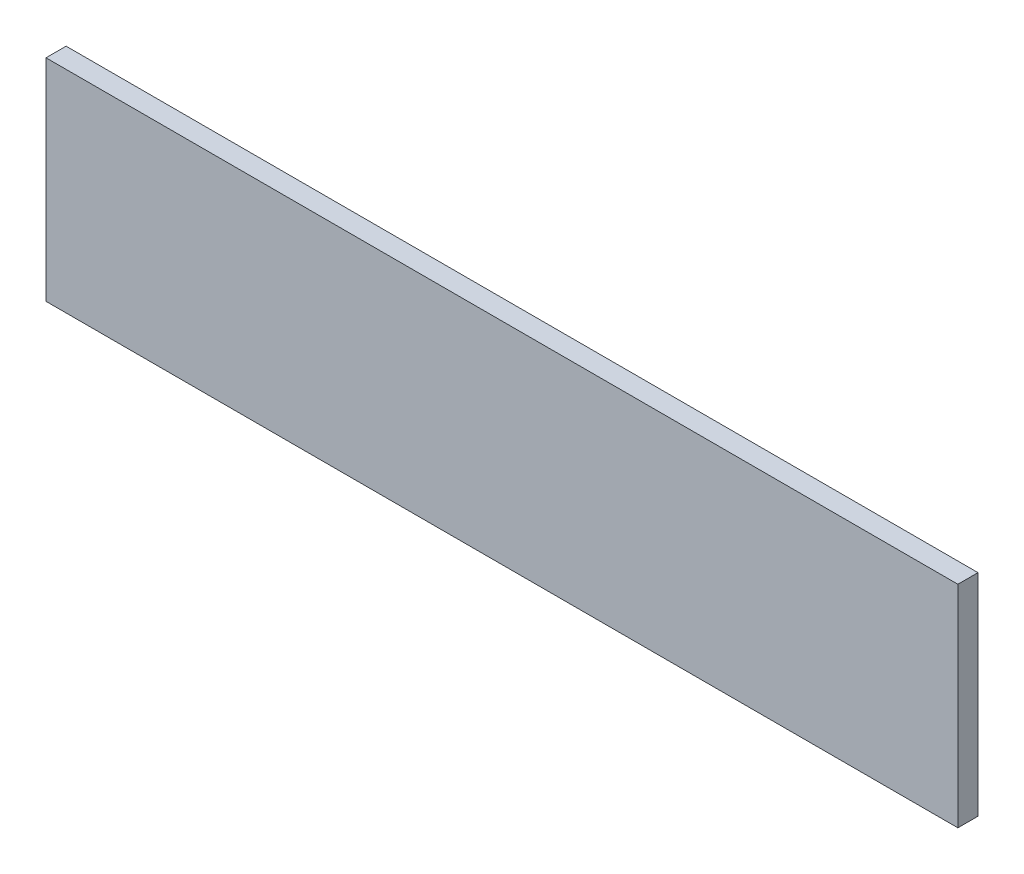
ISO-10303-21;
HEADER;
FILE_DESCRIPTION(('STEP AP214'),'2;1');
FILE_NAME('part.step','',(''),(''),'','','');
FILE_SCHEMA(('AUTOMOTIVE_DESIGN { 1 0 10303 214 1 1 1 1 }'));
ENDSEC;
DATA;
#1=APPLICATION_CONTEXT('core data for automotive mechanical design processes');
#2=APPLICATION_PROTOCOL_DEFINITION('international standard','automotive_design',2000,#1);
#3=PRODUCT_CONTEXT('',#1,'mechanical');
#4=PRODUCT('Part','Part','',(#3));
#5=PRODUCT_RELATED_PRODUCT_CATEGORY('part','',(#4));
#6=PRODUCT_DEFINITION_FORMATION('','',#4);
#7=PRODUCT_DEFINITION_CONTEXT('part definition',#1,'design');
#8=PRODUCT_DEFINITION('design','',#6,#7);
#9=PRODUCT_DEFINITION_SHAPE('','',#8);
#10=(LENGTH_UNIT() NAMED_UNIT(*) SI_UNIT(.MILLI.,.METRE.));
#11=(NAMED_UNIT(*) PLANE_ANGLE_UNIT() SI_UNIT($,.RADIAN.));
#12=(NAMED_UNIT(*) SI_UNIT($,.STERADIAN.) SOLID_ANGLE_UNIT());
#13=UNCERTAINTY_MEASURE_WITH_UNIT(LENGTH_MEASURE(1.E-05),#10,'distance_accuracy_value','');
#14=(GEOMETRIC_REPRESENTATION_CONTEXT(3) GLOBAL_UNCERTAINTY_ASSIGNED_CONTEXT((#13)) GLOBAL_UNIT_ASSIGNED_CONTEXT((#10,
#11,#12)) REPRESENTATION_CONTEXT('',''));
#15=CARTESIAN_POINT('',(0.,0.,0.));
#16=DIRECTION('',(0.,0.,1.));
#17=DIRECTION('',(1.,0.,0.));
#18=AXIS2_PLACEMENT_3D('',#15,#16,#17);
#19=CARTESIAN_POINT('',(138.67,32.08,-3.06));
#20=DIRECTION('',(0.,-1.,0.));
#21=DIRECTION('',(0.,0.,-1.));
#22=AXIS2_PLACEMENT_3D('',#19,#20,#21);
#23=PLANE('',#22);
#24=DIRECTION('',(0.,0.,1.));
#25=VECTOR('',#24,1.);
#26=CARTESIAN_POINT('',(0.,32.08,-3.06));
#27=LINE('',#26,#25);
#28=CARTESIAN_POINT('',(0.,32.08,-3.06));
#29=VERTEX_POINT('',#28);
#30=CARTESIAN_POINT('',(0.,32.08,0.));
#31=VERTEX_POINT('',#30);
#32=EDGE_CURVE('E102',#29,#31,#27,.T.);
#33=ORIENTED_EDGE('',*,*,#32,.T.);
#34=DIRECTION('',(-1.,0.,0.));
#35=VECTOR('',#34,1.);
#36=CARTESIAN_POINT('',(138.67,32.08,0.));
#37=LINE('',#36,#35);
#38=CARTESIAN_POINT('',(138.67,32.08,0.));
#39=VERTEX_POINT('',#38);
#40=EDGE_CURVE('E11',#39,#31,#37,.T.);
#41=ORIENTED_EDGE('',*,*,#40,.F.);
#42=DIRECTION('',(0.,0.,1.));
#43=VECTOR('',#42,1.);
#44=CARTESIAN_POINT('',(138.67,32.08,-3.06));
#45=LINE('',#44,#43);
#46=CARTESIAN_POINT('',(138.67,32.08,-3.06));
#47=VERTEX_POINT('',#46);
#48=EDGE_CURVE('E90',#47,#39,#45,.T.);
#49=ORIENTED_EDGE('',*,*,#48,.F.);
#50=DIRECTION('',(-1.,0.,0.));
#51=VECTOR('',#50,1.);
#52=CARTESIAN_POINT('',(138.67,32.08,-3.06));
#53=LINE('',#52,#51);
#54=EDGE_CURVE('E98',#47,#29,#53,.T.);
#55=ORIENTED_EDGE('',*,*,#54,.T.);
#56=EDGE_LOOP('',(#33,#41,#49,#55));
#57=FACE_BOUND('',#56,.T.);
#58=ADVANCED_FACE('F39',(#57),#23,.F.);
#59=CARTESIAN_POINT('',(138.67,32.08,0.));
#60=DIRECTION('',(0.,0.,-1.));
#61=DIRECTION('',(-1.,0.,0.));
#62=AXIS2_PLACEMENT_3D('',#59,#60,#61);
#63=PLANE('',#62);
#64=DIRECTION('',(0.,-1.,0.));
#65=VECTOR('',#64,1.);
#66=CARTESIAN_POINT('',(0.,32.08,0.));
#67=LINE('',#66,#65);
#68=CARTESIAN_POINT('',(0.,0.,0.));
#69=VERTEX_POINT('',#68);
#70=EDGE_CURVE('E94',#31,#69,#67,.T.);
#71=ORIENTED_EDGE('',*,*,#70,.T.);
#72=DIRECTION('',(-1.,0.,0.));
#73=VECTOR('',#72,1.);
#74=CARTESIAN_POINT('',(138.67,0.,0.));
#75=LINE('',#74,#73);
#76=CARTESIAN_POINT('',(138.67,0.,0.));
#77=VERTEX_POINT('',#76);
#78=EDGE_CURVE('E47',#77,#69,#75,.T.);
#79=ORIENTED_EDGE('',*,*,#78,.F.);
#80=DIRECTION('',(0.,-1.,0.));
#81=VECTOR('',#80,1.);
#82=CARTESIAN_POINT('',(138.67,32.08,0.));
#83=LINE('',#82,#81);
#84=EDGE_CURVE('E85',#39,#77,#83,.T.);
#85=ORIENTED_EDGE('',*,*,#84,.F.);
#86=ORIENTED_EDGE('',*,*,#40,.T.);
#87=EDGE_LOOP('',(#71,#79,#85,#86));
#88=FACE_BOUND('',#87,.T.);
#89=ADVANCED_FACE('F93',(#88),#63,.F.);
#90=CARTESIAN_POINT('',(138.67,0.,-3.06));
#91=DIRECTION('',(0.,1.,0.));
#92=DIRECTION('',(0.,0.,1.));
#93=AXIS2_PLACEMENT_3D('',#90,#91,#92);
#94=PLANE('',#93);
#95=DIRECTION('',(0.,0.,-1.));
#96=VECTOR('',#95,1.);
#97=CARTESIAN_POINT('',(0.,0.,-3.06));
#98=LINE('',#97,#96);
#99=CARTESIAN_POINT('',(0.,0.,-3.06));
#100=VERTEX_POINT('',#99);
#101=EDGE_CURVE('E72',#69,#100,#98,.T.);
#102=ORIENTED_EDGE('',*,*,#101,.T.);
#103=DIRECTION('',(-1.,0.,0.));
#104=VECTOR('',#103,1.);
#105=CARTESIAN_POINT('',(138.67,0.,-3.06));
#106=LINE('',#105,#104);
#107=CARTESIAN_POINT('',(138.67,0.,-3.06));
#108=VERTEX_POINT('',#107);
#109=EDGE_CURVE('E95',#108,#100,#106,.T.);
#110=ORIENTED_EDGE('',*,*,#109,.F.);
#111=DIRECTION('',(0.,0.,-1.));
#112=VECTOR('',#111,1.);
#113=CARTESIAN_POINT('',(138.67,0.,-3.06));
#114=LINE('',#113,#112);
#115=EDGE_CURVE('E88',#77,#108,#114,.T.);
#116=ORIENTED_EDGE('',*,*,#115,.F.);
#117=ORIENTED_EDGE('',*,*,#78,.T.);
#118=EDGE_LOOP('',(#102,#110,#116,#117));
#119=FACE_BOUND('',#118,.T.);
#120=ADVANCED_FACE('F96',(#119),#94,.F.);
#121=CARTESIAN_POINT('',(138.67,32.08,-3.06));
#122=DIRECTION('',(0.,0.,1.));
#123=DIRECTION('',(1.,0.,0.));
#124=AXIS2_PLACEMENT_3D('',#121,#122,#123);
#125=PLANE('',#124);
#126=DIRECTION('',(0.,1.,0.));
#127=VECTOR('',#126,1.);
#128=CARTESIAN_POINT('',(0.,32.08,-3.06));
#129=LINE('',#128,#127);
#130=EDGE_CURVE('E78',#100,#29,#129,.T.);
#131=ORIENTED_EDGE('',*,*,#130,.T.);
#132=ORIENTED_EDGE('',*,*,#54,.F.);
#133=DIRECTION('',(0.,1.,0.));
#134=VECTOR('',#133,1.);
#135=CARTESIAN_POINT('',(138.67,32.08,-3.06));
#136=LINE('',#135,#134);
#137=EDGE_CURVE('E55',#108,#47,#136,.T.);
#138=ORIENTED_EDGE('',*,*,#137,.F.);
#139=ORIENTED_EDGE('',*,*,#109,.T.);
#140=EDGE_LOOP('',(#131,#132,#138,#139));
#141=FACE_BOUND('',#140,.T.);
#142=ADVANCED_FACE('F109',(#141),#125,.F.);
#143=CARTESIAN_POINT('',(138.67,0.,0.));
#144=DIRECTION('',(1.,0.,0.));
#145=DIRECTION('',(0.,0.,-1.));
#146=AXIS2_PLACEMENT_3D('',#143,#144,#145);
#147=PLANE('',#146);
#148=ORIENTED_EDGE('',*,*,#48,.T.);
#149=ORIENTED_EDGE('',*,*,#84,.T.);
#150=ORIENTED_EDGE('',*,*,#115,.T.);
#151=ORIENTED_EDGE('',*,*,#137,.T.);
#152=EDGE_LOOP('',(#148,#149,#150,#151));
#153=FACE_BOUND('',#152,.T.);
#154=ADVANCED_FACE('F86',(#153),#147,.T.);
#155=CARTESIAN_POINT('',(0.,0.,0.));
#156=DIRECTION('',(1.,0.,0.));
#157=DIRECTION('',(0.,0.,-1.));
#158=AXIS2_PLACEMENT_3D('',#155,#156,#157);
#159=PLANE('',#158);
#160=ORIENTED_EDGE('',*,*,#32,.F.);
#161=ORIENTED_EDGE('',*,*,#130,.F.);
#162=ORIENTED_EDGE('',*,*,#101,.F.);
#163=ORIENTED_EDGE('',*,*,#70,.F.);
#164=EDGE_LOOP('',(#160,#161,#162,#163));
#165=FACE_BOUND('',#164,.T.);
#166=ADVANCED_FACE('F112',(#165),#159,.F.);
#167=CLOSED_SHELL('',(#58,#89,#120,#142,#154,#166));
#168=MANIFOLD_SOLID_BREP('B2',#167);
#169=ADVANCED_BREP_SHAPE_REPRESENTATION('',(#18,#168),#14);
#170=SHAPE_DEFINITION_REPRESENTATION(#9,#169);
ENDSEC;
END-ISO-10303-21;
